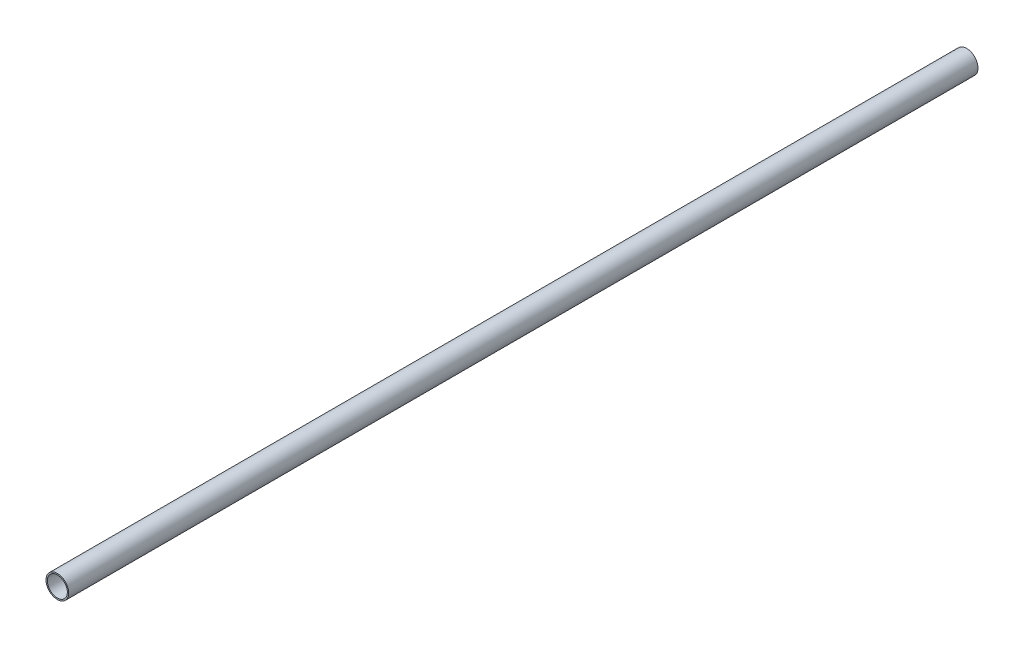
ISO-10303-21;
HEADER;
FILE_DESCRIPTION(('STEP AP214'),'2;1');
FILE_NAME('part.step','',(''),(''),'','','');
FILE_SCHEMA(('AUTOMOTIVE_DESIGN { 1 0 10303 214 1 1 1 1 }'));
ENDSEC;
DATA;
#1=APPLICATION_CONTEXT('core data for automotive mechanical design processes');
#2=APPLICATION_PROTOCOL_DEFINITION('international standard','automotive_design',2000,#1);
#3=PRODUCT_CONTEXT('',#1,'mechanical');
#4=PRODUCT('Part','Part','',(#3));
#5=PRODUCT_RELATED_PRODUCT_CATEGORY('part','',(#4));
#6=PRODUCT_DEFINITION_FORMATION('','',#4);
#7=PRODUCT_DEFINITION_CONTEXT('part definition',#1,'design');
#8=PRODUCT_DEFINITION('design','',#6,#7);
#9=PRODUCT_DEFINITION_SHAPE('','',#8);
#10=(LENGTH_UNIT() NAMED_UNIT(*) SI_UNIT(.MILLI.,.METRE.));
#11=(NAMED_UNIT(*) PLANE_ANGLE_UNIT() SI_UNIT($,.RADIAN.));
#12=(NAMED_UNIT(*) SI_UNIT($,.STERADIAN.) SOLID_ANGLE_UNIT());
#13=UNCERTAINTY_MEASURE_WITH_UNIT(LENGTH_MEASURE(1.E-05),#10,'distance_accuracy_value','');
#14=(GEOMETRIC_REPRESENTATION_CONTEXT(3) GLOBAL_UNCERTAINTY_ASSIGNED_CONTEXT((#13)) GLOBAL_UNIT_ASSIGNED_CONTEXT((#10,
#11,#12)) REPRESENTATION_CONTEXT('',''));
#15=CARTESIAN_POINT('',(0.,0.,0.));
#16=DIRECTION('',(0.,0.,1.));
#17=DIRECTION('',(1.,0.,0.));
#18=AXIS2_PLACEMENT_3D('',#15,#16,#17);
#19=CARTESIAN_POINT('',(0.,0.,1000.));
#20=DIRECTION('',(0.,0.,1.));
#21=DIRECTION('',(1.,0.,0.));
#22=AXIS2_PLACEMENT_3D('',#19,#20,#21);
#23=PLANE('',#22);
#24=CARTESIAN_POINT('',(0.,0.,1000.));
#25=DIRECTION('',(0.,0.,1.));
#26=DIRECTION('',(1.,0.,0.));
#27=AXIS2_PLACEMENT_3D('',#24,#25,#26);
#28=CIRCLE('',#27,12.5);
#29=CARTESIAN_POINT('',(12.5,0.,1000.));
#30=VERTEX_POINT('',#29);
#31=EDGE_CURVE('E10',#30,#30,#28,.T.);
#32=ORIENTED_EDGE('',*,*,#31,.T.);
#33=EDGE_LOOP('',(#32));
#34=FACE_BOUND('',#33,.T.);
#35=CARTESIAN_POINT('',(0.,0.,1000.));
#36=DIRECTION('',(0.,0.,1.));
#37=DIRECTION('',(1.,0.,0.));
#38=AXIS2_PLACEMENT_3D('',#35,#36,#37);
#39=CIRCLE('',#38,11.);
#40=CARTESIAN_POINT('',(11.,0.,1000.));
#41=VERTEX_POINT('',#40);
#42=EDGE_CURVE('E50',#41,#41,#39,.T.);
#43=ORIENTED_EDGE('',*,*,#42,.F.);
#44=EDGE_LOOP('',(#43));
#45=FACE_BOUND('',#44,.T.);
#46=ADVANCED_FACE('F39',(#34,#45),#23,.T.);
#47=CARTESIAN_POINT('',(0.,0.,0.));
#48=DIRECTION('',(0.,0.,1.));
#49=DIRECTION('',(1.,0.,0.));
#50=AXIS2_PLACEMENT_3D('',#47,#48,#49);
#51=PLANE('',#50);
#52=CARTESIAN_POINT('',(0.,0.,0.));
#53=DIRECTION('',(0.,0.,1.));
#54=DIRECTION('',(1.,0.,0.));
#55=AXIS2_PLACEMENT_3D('',#52,#53,#54);
#56=CIRCLE('',#55,12.5);
#57=CARTESIAN_POINT('',(12.5,0.,0.));
#58=VERTEX_POINT('',#57);
#59=EDGE_CURVE('E43',#58,#58,#56,.T.);
#60=ORIENTED_EDGE('',*,*,#59,.F.);
#61=EDGE_LOOP('',(#60));
#62=FACE_BOUND('',#61,.T.);
#63=CARTESIAN_POINT('',(0.,0.,0.));
#64=DIRECTION('',(0.,0.,1.));
#65=DIRECTION('',(1.,0.,0.));
#66=AXIS2_PLACEMENT_3D('',#63,#64,#65);
#67=CIRCLE('',#66,11.);
#68=CARTESIAN_POINT('',(11.,0.,0.));
#69=VERTEX_POINT('',#68);
#70=EDGE_CURVE('E52',#69,#69,#67,.T.);
#71=ORIENTED_EDGE('',*,*,#70,.T.);
#72=EDGE_LOOP('',(#71));
#73=FACE_BOUND('',#72,.T.);
#74=ADVANCED_FACE('F62',(#62,#73),#51,.F.);
#75=CARTESIAN_POINT('',(0.,0.,1000.));
#76=DIRECTION('',(0.,0.,-1.));
#77=DIRECTION('',(-1.,0.,0.));
#78=AXIS2_PLACEMENT_3D('',#75,#76,#77);
#79=CYLINDRICAL_SURFACE('',#78,12.5);
#80=ORIENTED_EDGE('',*,*,#31,.F.);
#81=EDGE_LOOP('',(#80));
#82=FACE_BOUND('',#81,.T.);
#83=ORIENTED_EDGE('',*,*,#59,.T.);
#84=EDGE_LOOP('',(#83));
#85=FACE_BOUND('',#84,.T.);
#86=ADVANCED_FACE('F41',(#82,#85),#79,.T.);
#87=CARTESIAN_POINT('',(0.,0.,1000.));
#88=DIRECTION('',(0.,0.,-1.));
#89=DIRECTION('',(-1.,0.,0.));
#90=AXIS2_PLACEMENT_3D('',#87,#88,#89);
#91=CYLINDRICAL_SURFACE('',#90,11.);
#92=ORIENTED_EDGE('',*,*,#42,.T.);
#93=EDGE_LOOP('',(#92));
#94=FACE_BOUND('',#93,.T.);
#95=ORIENTED_EDGE('',*,*,#70,.F.);
#96=EDGE_LOOP('',(#95));
#97=FACE_BOUND('',#96,.T.);
#98=ADVANCED_FACE('F58',(#94,#97),#91,.F.);
#99=CLOSED_SHELL('',(#46,#74,#86,#98));
#100=MANIFOLD_SOLID_BREP('B2',#99);
#101=ADVANCED_BREP_SHAPE_REPRESENTATION('',(#18,#100),#14);
#102=SHAPE_DEFINITION_REPRESENTATION(#9,#101);
ENDSEC;
END-ISO-10303-21;
